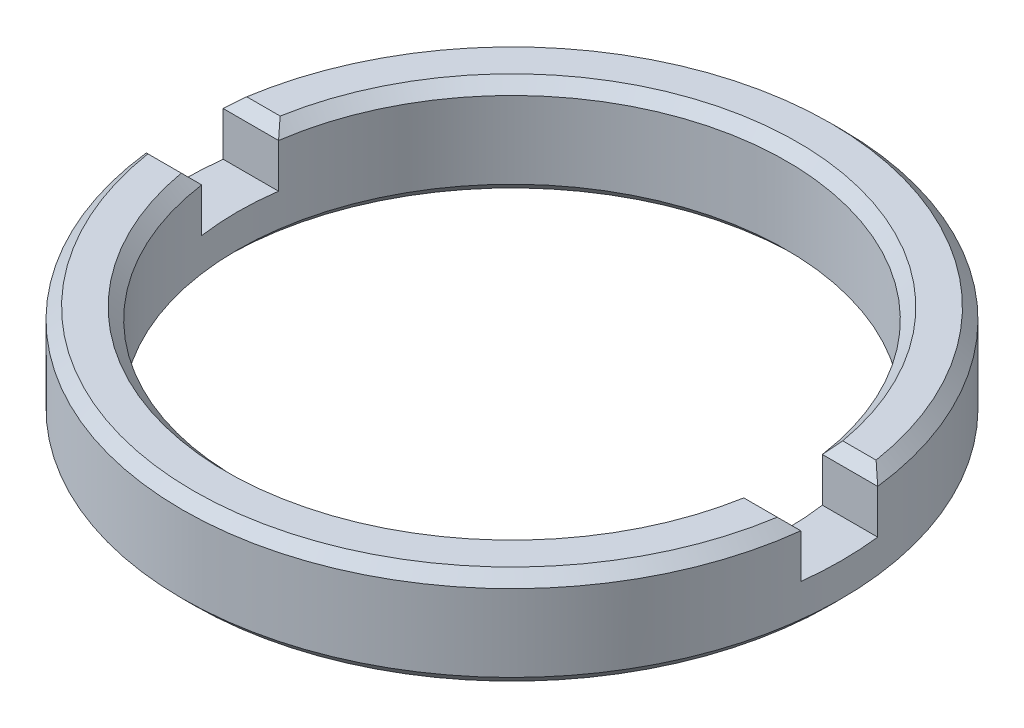
ISO-10303-21;
HEADER;
FILE_DESCRIPTION(('STEP AP214'),'2;1');
FILE_NAME('part.step','',(''),(''),'','','');
FILE_SCHEMA(('AUTOMOTIVE_DESIGN { 1 0 10303 214 1 1 1 1 }'));
ENDSEC;
DATA;
#1=APPLICATION_CONTEXT('core data for automotive mechanical design processes');
#2=APPLICATION_PROTOCOL_DEFINITION('international standard','automotive_design',2000,#1);
#3=PRODUCT_CONTEXT('',#1,'mechanical');
#4=PRODUCT('Part','Part','',(#3));
#5=PRODUCT_RELATED_PRODUCT_CATEGORY('part','',(#4));
#6=PRODUCT_DEFINITION_FORMATION('','',#4);
#7=PRODUCT_DEFINITION_CONTEXT('part definition',#1,'design');
#8=PRODUCT_DEFINITION('design','',#6,#7);
#9=PRODUCT_DEFINITION_SHAPE('','',#8);
#10=(LENGTH_UNIT() NAMED_UNIT(*) SI_UNIT(.MILLI.,.METRE.));
#11=(NAMED_UNIT(*) PLANE_ANGLE_UNIT() SI_UNIT($,.RADIAN.));
#12=(NAMED_UNIT(*) SI_UNIT($,.STERADIAN.) SOLID_ANGLE_UNIT());
#13=UNCERTAINTY_MEASURE_WITH_UNIT(LENGTH_MEASURE(1.E-05),#10,'distance_accuracy_value','');
#14=(GEOMETRIC_REPRESENTATION_CONTEXT(3) GLOBAL_UNCERTAINTY_ASSIGNED_CONTEXT((#13)) GLOBAL_UNIT_ASSIGNED_CONTEXT((#10,
#11,#12)) REPRESENTATION_CONTEXT('',''));
#15=CARTESIAN_POINT('',(0.,0.,0.));
#16=DIRECTION('',(0.,0.,1.));
#17=DIRECTION('',(1.,0.,0.));
#18=AXIS2_PLACEMENT_3D('',#15,#16,#17);
#19=CARTESIAN_POINT('',(0.,0.5715,0.));
#20=DIRECTION('',(0.,-1.,0.));
#21=DIRECTION('',(0.,0.,-1.));
#22=AXIS2_PLACEMENT_3D('',#19,#20,#21);
#23=CYLINDRICAL_SURFACE('',#22,3.81);
#24=CARTESIAN_POINT('',(0.,-0.444500000000001,0.));
#25=DIRECTION('',(0.,1.,0.));
#26=DIRECTION('',(0.,0.,1.));
#27=AXIS2_PLACEMENT_3D('',#24,#25,#26);
#28=CIRCLE('',#27,3.81);
#29=CARTESIAN_POINT('',(0.,-0.444500000000001,3.81));
#30=VERTEX_POINT('',#29);
#31=EDGE_CURVE('E168',#30,#30,#28,.T.);
#32=ORIENTED_EDGE('',*,*,#31,.T.);
#33=EDGE_LOOP('',(#32));
#34=FACE_BOUND('',#33,.T.);
#35=DIRECTION('',(0.,1.,0.));
#36=VECTOR('',#35,1.);
#37=CARTESIAN_POINT('',(-3.78398199652165,-0.0635000000000001,-0.4445));
#38=LINE('',#37,#36);
#39=CARTESIAN_POINT('',(-3.78398199652165,-0.0635000000000001,-0.4445));
#40=VERTEX_POINT('',#39);
#41=CARTESIAN_POINT('',(-3.78398199652165,0.4445,-0.4445));
#42=VERTEX_POINT('',#41);
#43=EDGE_CURVE('E137',#40,#42,#38,.T.);
#44=ORIENTED_EDGE('',*,*,#43,.T.);
#45=CARTESIAN_POINT('',(0.,0.4445,0.));
#46=DIRECTION('',(0.,1.,0.));
#47=DIRECTION('',(0.,0.,1.));
#48=AXIS2_PLACEMENT_3D('',#45,#46,#47);
#49=CIRCLE('',#48,3.81);
#50=CARTESIAN_POINT('',(3.78398199652165,0.4445,-0.4445));
#51=VERTEX_POINT('',#50);
#52=EDGE_CURVE('E166',#42,#51,#49,.F.);
#53=ORIENTED_EDGE('',*,*,#52,.T.);
#54=DIRECTION('',(0.,1.,0.));
#55=VECTOR('',#54,1.);
#56=CARTESIAN_POINT('',(3.78398199652165,-0.0635000000000001,-0.4445));
#57=LINE('',#56,#55);
#58=CARTESIAN_POINT('',(3.78398199652165,-0.0635000000000001,-0.4445));
#59=VERTEX_POINT('',#58);
#60=EDGE_CURVE('E154',#59,#51,#57,.T.);
#61=ORIENTED_EDGE('',*,*,#60,.F.);
#62=CARTESIAN_POINT('',(0.,-0.0635000000000001,0.));
#63=DIRECTION('',(0.,-1.,0.));
#64=DIRECTION('',(0.,0.,-1.));
#65=AXIS2_PLACEMENT_3D('',#62,#63,#64);
#66=CIRCLE('',#65,3.81);
#67=CARTESIAN_POINT('',(3.78398199652165,-0.0635000000000001,0.4445));
#68=VERTEX_POINT('',#67);
#69=EDGE_CURVE('E139',#59,#68,#66,.T.);
#70=ORIENTED_EDGE('',*,*,#69,.T.);
#71=DIRECTION('',(0.,1.,0.));
#72=VECTOR('',#71,1.);
#73=CARTESIAN_POINT('',(3.78398199652165,-0.0635000000000001,0.4445));
#74=LINE('',#73,#72);
#75=CARTESIAN_POINT('',(3.78398199652165,0.4445,0.4445));
#76=VERTEX_POINT('',#75);
#77=EDGE_CURVE('E163',#68,#76,#74,.T.);
#78=ORIENTED_EDGE('',*,*,#77,.T.);
#79=CARTESIAN_POINT('',(0.,0.4445,0.));
#80=DIRECTION('',(0.,1.,0.));
#81=DIRECTION('',(0.,0.,1.));
#82=AXIS2_PLACEMENT_3D('',#79,#80,#81);
#83=CIRCLE('',#82,3.81);
#84=CARTESIAN_POINT('',(-3.78398199652165,0.4445,0.444500000000001));
#85=VERTEX_POINT('',#84);
#86=EDGE_CURVE('E136',#76,#85,#83,.F.);
#87=ORIENTED_EDGE('',*,*,#86,.T.);
#88=DIRECTION('',(0.,1.,0.));
#89=VECTOR('',#88,1.);
#90=CARTESIAN_POINT('',(-3.78398199652165,-0.0635000000000001,0.444500000000001));
#91=LINE('',#90,#89);
#92=CARTESIAN_POINT('',(-3.78398199652165,-0.0635000000000001,0.444500000000001));
#93=VERTEX_POINT('',#92);
#94=EDGE_CURVE('E117',#93,#85,#91,.T.);
#95=ORIENTED_EDGE('',*,*,#94,.F.);
#96=CARTESIAN_POINT('',(0.,-0.0635000000000001,0.));
#97=DIRECTION('',(0.,-1.,0.));
#98=DIRECTION('',(0.,0.,-1.));
#99=AXIS2_PLACEMENT_3D('',#96,#97,#98);
#100=CIRCLE('',#99,3.81);
#101=EDGE_CURVE('E124',#93,#40,#100,.T.);
#102=ORIENTED_EDGE('',*,*,#101,.T.);
#103=EDGE_LOOP('',(#44,#53,#61,#70,#78,#87,#95,#102));
#104=FACE_BOUND('',#103,.T.);
#105=ADVANCED_FACE('F16',(#34,#104),#23,.T.);
#106=CARTESIAN_POINT('',(0.,0.5715,0.));
#107=DIRECTION('',(0.,1.,0.));
#108=DIRECTION('',(0.,0.,1.));
#109=AXIS2_PLACEMENT_3D('',#106,#107,#108);
#110=PLANE('',#109);
#111=DIRECTION('',(-1.,0.,0.));
#112=VECTOR('',#111,1.);
#113=CARTESIAN_POINT('',(0.,0.5715,0.571500000000001));
#114=LINE('',#113,#112);
#115=CARTESIAN_POINT('',(3.6383893070973,0.5715,0.571500000000001));
#116=VERTEX_POINT('',#115);
#117=CARTESIAN_POINT('',(3.25216723893468,0.5715,0.571500000000001));
#118=VERTEX_POINT('',#117);
#119=EDGE_CURVE('E37',#116,#118,#114,.T.);
#120=ORIENTED_EDGE('',*,*,#119,.T.);
#121=CARTESIAN_POINT('',(0.,0.5715,0.));
#122=DIRECTION('',(0.,1.,0.));
#123=DIRECTION('',(0.,0.,1.));
#124=AXIS2_PLACEMENT_3D('',#121,#122,#123);
#125=CIRCLE('',#124,3.302);
#126=CARTESIAN_POINT('',(-3.25216723893468,0.5715,0.571500000000001));
#127=VERTEX_POINT('',#126);
#128=EDGE_CURVE('E204',#118,#127,#125,.F.);
#129=ORIENTED_EDGE('',*,*,#128,.T.);
#130=DIRECTION('',(-1.,0.,0.));
#131=VECTOR('',#130,1.);
#132=CARTESIAN_POINT('',(0.,0.5715,0.571500000000001));
#133=LINE('',#132,#131);
#134=CARTESIAN_POINT('',(-3.6383893070973,0.5715,0.571500000000001));
#135=VERTEX_POINT('',#134);
#136=EDGE_CURVE('E201',#127,#135,#133,.T.);
#137=ORIENTED_EDGE('',*,*,#136,.T.);
#138=CARTESIAN_POINT('',(0.,0.5715,0.));
#139=DIRECTION('',(0.,1.,0.));
#140=DIRECTION('',(0.,0.,1.));
#141=AXIS2_PLACEMENT_3D('',#138,#139,#140);
#142=CIRCLE('',#141,3.683);
#143=EDGE_CURVE('E199',#135,#116,#142,.T.);
#144=ORIENTED_EDGE('',*,*,#143,.T.);
#145=EDGE_LOOP('',(#120,#129,#137,#144));
#146=FACE_BOUND('',#145,.T.);
#147=ADVANCED_FACE('F277',(#146),#110,.T.);
#148=DIRECTION('',(1.,0.,0.));
#149=VECTOR('',#148,1.);
#150=CARTESIAN_POINT('',(0.,0.5715,-0.571500000000001));
#151=LINE('',#150,#149);
#152=CARTESIAN_POINT('',(-3.6383893070973,0.5715,-0.571500000000001));
#153=VERTEX_POINT('',#152);
#154=CARTESIAN_POINT('',(-3.25216723893468,0.5715,-0.571500000000001));
#155=VERTEX_POINT('',#154);
#156=EDGE_CURVE('E188',#153,#155,#151,.T.);
#157=ORIENTED_EDGE('',*,*,#156,.T.);
#158=CARTESIAN_POINT('',(0.,0.5715,0.));
#159=DIRECTION('',(0.,1.,0.));
#160=DIRECTION('',(0.,0.,1.));
#161=AXIS2_PLACEMENT_3D('',#158,#159,#160);
#162=CIRCLE('',#161,3.302);
#163=CARTESIAN_POINT('',(3.25216723893468,0.5715,-0.571500000000001));
#164=VERTEX_POINT('',#163);
#165=EDGE_CURVE('E192',#155,#164,#162,.F.);
#166=ORIENTED_EDGE('',*,*,#165,.T.);
#167=DIRECTION('',(1.,0.,0.));
#168=VECTOR('',#167,1.);
#169=CARTESIAN_POINT('',(0.,0.5715,-0.571500000000001));
#170=LINE('',#169,#168);
#171=CARTESIAN_POINT('',(3.6383893070973,0.5715,-0.571500000000001));
#172=VERTEX_POINT('',#171);
#173=EDGE_CURVE('E190',#164,#172,#170,.T.);
#174=ORIENTED_EDGE('',*,*,#173,.T.);
#175=CARTESIAN_POINT('',(0.,0.5715,0.));
#176=DIRECTION('',(0.,1.,0.));
#177=DIRECTION('',(0.,0.,1.));
#178=AXIS2_PLACEMENT_3D('',#175,#176,#177);
#179=CIRCLE('',#178,3.683);
#180=EDGE_CURVE('E186',#172,#153,#179,.T.);
#181=ORIENTED_EDGE('',*,*,#180,.T.);
#182=EDGE_LOOP('',(#157,#166,#174,#181));
#183=FACE_BOUND('',#182,.T.);
#184=ADVANCED_FACE('F283',(#183),#110,.T.);
#185=CARTESIAN_POINT('',(0.,0.5715,0.));
#186=DIRECTION('',(0.,-1.,0.));
#187=DIRECTION('',(0.,0.,-1.));
#188=AXIS2_PLACEMENT_3D('',#185,#186,#187);
#189=CYLINDRICAL_SURFACE('',#188,3.175);
#190=CARTESIAN_POINT('',(0.,-0.4445,0.));
#191=DIRECTION('',(0.,1.,0.));
#192=DIRECTION('',(0.,0.,1.));
#193=AXIS2_PLACEMENT_3D('',#190,#191,#192);
#194=CIRCLE('',#193,3.175);
#195=CARTESIAN_POINT('',(0.,-0.4445,3.175));
#196=VERTEX_POINT('',#195);
#197=EDGE_CURVE('E183',#196,#196,#194,.F.);
#198=ORIENTED_EDGE('',*,*,#197,.T.);
#199=EDGE_LOOP('',(#198));
#200=FACE_BOUND('',#199,.T.);
#201=DIRECTION('',(0.,1.,0.));
#202=VECTOR('',#201,1.);
#203=CARTESIAN_POINT('',(3.14373102379959,-0.0635000000000001,-0.4445));
#204=LINE('',#203,#202);
#205=CARTESIAN_POINT('',(3.14373102379959,-0.0635000000000001,-0.4445));
#206=VERTEX_POINT('',#205);
#207=CARTESIAN_POINT('',(3.14373102379959,0.4445,-0.4445));
#208=VERTEX_POINT('',#207);
#209=EDGE_CURVE('E157',#206,#208,#204,.T.);
#210=ORIENTED_EDGE('',*,*,#209,.T.);
#211=CARTESIAN_POINT('',(0.,0.4445,0.));
#212=DIRECTION('',(0.,1.,0.));
#213=DIRECTION('',(0.,0.,1.));
#214=AXIS2_PLACEMENT_3D('',#211,#212,#213);
#215=CIRCLE('',#214,3.175);
#216=CARTESIAN_POINT('',(-3.14373102379959,0.4445,-0.4445));
#217=VERTEX_POINT('',#216);
#218=EDGE_CURVE('E180',#208,#217,#215,.T.);
#219=ORIENTED_EDGE('',*,*,#218,.T.);
#220=DIRECTION('',(0.,1.,0.));
#221=VECTOR('',#220,1.);
#222=CARTESIAN_POINT('',(-3.14373102379959,-0.0635000000000001,-0.4445));
#223=LINE('',#222,#221);
#224=CARTESIAN_POINT('',(-3.14373102379959,-0.0635000000000001,-0.4445));
#225=VERTEX_POINT('',#224);
#226=EDGE_CURVE('E141',#225,#217,#223,.T.);
#227=ORIENTED_EDGE('',*,*,#226,.F.);
#228=CARTESIAN_POINT('',(0.,-0.0635000000000001,0.));
#229=DIRECTION('',(0.,1.,0.));
#230=DIRECTION('',(0.,0.,-1.));
#231=AXIS2_PLACEMENT_3D('',#228,#229,#230);
#232=CIRCLE('',#231,3.175);
#233=CARTESIAN_POINT('',(-3.14373102379959,-0.0635000000000001,0.4445));
#234=VERTEX_POINT('',#233);
#235=EDGE_CURVE('E125',#225,#234,#232,.T.);
#236=ORIENTED_EDGE('',*,*,#235,.T.);
#237=DIRECTION('',(0.,1.,0.));
#238=VECTOR('',#237,1.);
#239=CARTESIAN_POINT('',(-3.14373102379959,-0.0635000000000001,0.4445));
#240=LINE('',#239,#238);
#241=CARTESIAN_POINT('',(-3.14373102379959,0.4445,0.4445));
#242=VERTEX_POINT('',#241);
#243=EDGE_CURVE('E120',#234,#242,#240,.T.);
#244=ORIENTED_EDGE('',*,*,#243,.T.);
#245=CARTESIAN_POINT('',(0.,0.4445,0.));
#246=DIRECTION('',(0.,1.,0.));
#247=DIRECTION('',(0.,0.,1.));
#248=AXIS2_PLACEMENT_3D('',#245,#246,#247);
#249=CIRCLE('',#248,3.175);
#250=CARTESIAN_POINT('',(3.14373102379959,0.4445,0.4445));
#251=VERTEX_POINT('',#250);
#252=EDGE_CURVE('E177',#242,#251,#249,.T.);
#253=ORIENTED_EDGE('',*,*,#252,.T.);
#254=DIRECTION('',(0.,1.,0.));
#255=VECTOR('',#254,1.);
#256=CARTESIAN_POINT('',(3.14373102379959,-0.0635000000000001,0.4445));
#257=LINE('',#256,#255);
#258=CARTESIAN_POINT('',(3.14373102379959,-0.0635000000000001,0.4445));
#259=VERTEX_POINT('',#258);
#260=EDGE_CURVE('E160',#259,#251,#257,.T.);
#261=ORIENTED_EDGE('',*,*,#260,.F.);
#262=CARTESIAN_POINT('',(0.,-0.0635000000000001,0.));
#263=DIRECTION('',(0.,1.,0.));
#264=DIRECTION('',(0.,0.,-1.));
#265=AXIS2_PLACEMENT_3D('',#262,#263,#264);
#266=CIRCLE('',#265,3.175);
#267=EDGE_CURVE('E149',#259,#206,#266,.T.);
#268=ORIENTED_EDGE('',*,*,#267,.T.);
#269=EDGE_LOOP('',(#210,#219,#227,#236,#244,#253,#261,#268));
#270=FACE_BOUND('',#269,.T.);
#271=ADVANCED_FACE('F302',(#200,#270),#189,.F.);
#272=CARTESIAN_POINT('',(0.,-0.5715,0.));
#273=DIRECTION('',(0.,1.,0.));
#274=DIRECTION('',(0.,0.,1.));
#275=AXIS2_PLACEMENT_3D('',#272,#273,#274);
#276=PLANE('',#275);
#277=CARTESIAN_POINT('',(0.,-0.5715,0.));
#278=DIRECTION('',(0.,1.,0.));
#279=DIRECTION('',(0.,0.,1.));
#280=AXIS2_PLACEMENT_3D('',#277,#278,#279);
#281=CIRCLE('',#280,3.683);
#282=CARTESIAN_POINT('',(0.,-0.5715,3.683));
#283=VERTEX_POINT('',#282);
#284=EDGE_CURVE('E174',#283,#283,#281,.F.);
#285=ORIENTED_EDGE('',*,*,#284,.T.);
#286=EDGE_LOOP('',(#285));
#287=FACE_BOUND('',#286,.T.);
#288=CARTESIAN_POINT('',(0.,-0.5715,0.));
#289=DIRECTION('',(0.,1.,0.));
#290=DIRECTION('',(0.,0.,1.));
#291=AXIS2_PLACEMENT_3D('',#288,#289,#290);
#292=CIRCLE('',#291,3.302);
#293=CARTESIAN_POINT('',(0.,-0.5715,3.302));
#294=VERTEX_POINT('',#293);
#295=EDGE_CURVE('E171',#294,#294,#292,.T.);
#296=ORIENTED_EDGE('',*,*,#295,.T.);
#297=EDGE_LOOP('',(#296));
#298=FACE_BOUND('',#297,.T.);
#299=ADVANCED_FACE('F287',(#287,#298),#276,.F.);
#300=CARTESIAN_POINT('',(3.14373102379959,-0.0635000000000001,0.4445));
#301=DIRECTION('',(0.,0.,-1.));
#302=DIRECTION('',(-1.,0.,0.));
#303=AXIS2_PLACEMENT_3D('',#300,#301,#302);
#304=PLANE('',#303);
#305=ORIENTED_EDGE('',*,*,#260,.T.);
#306=DIRECTION('',(1.,0.,0.));
#307=VECTOR('',#306,1.);
#308=CARTESIAN_POINT('',(3.14373102379959,0.4445,0.4445));
#309=LINE('',#308,#307);
#310=EDGE_CURVE('E29',#251,#76,#309,.T.);
#311=ORIENTED_EDGE('',*,*,#310,.T.);
#312=ORIENTED_EDGE('',*,*,#77,.F.);
#313=DIRECTION('',(-1.,0.,0.));
#314=VECTOR('',#313,1.);
#315=CARTESIAN_POINT('',(3.14373102379959,-0.0635000000000001,0.4445));
#316=LINE('',#315,#314);
#317=EDGE_CURVE('E147',#68,#259,#316,.T.);
#318=ORIENTED_EDGE('',*,*,#317,.T.);
#319=EDGE_LOOP('',(#305,#311,#312,#318));
#320=FACE_BOUND('',#319,.T.);
#321=ADVANCED_FACE('F347',(#320),#304,.T.);
#322=CARTESIAN_POINT('',(3.14373102379959,-0.0635000000000001,-0.4445));
#323=DIRECTION('',(0.,0.,1.));
#324=DIRECTION('',(1.,0.,0.));
#325=AXIS2_PLACEMENT_3D('',#322,#323,#324);
#326=PLANE('',#325);
#327=ORIENTED_EDGE('',*,*,#60,.T.);
#328=DIRECTION('',(-1.,0.,0.));
#329=VECTOR('',#328,1.);
#330=CARTESIAN_POINT('',(3.14373102379959,0.4445,-0.4445));
#331=LINE('',#330,#329);
#332=EDGE_CURVE('E195',#51,#208,#331,.T.);
#333=ORIENTED_EDGE('',*,*,#332,.T.);
#334=ORIENTED_EDGE('',*,*,#209,.F.);
#335=DIRECTION('',(1.,0.,0.));
#336=VECTOR('',#335,1.);
#337=CARTESIAN_POINT('',(3.14373102379959,-0.0635000000000001,-0.4445));
#338=LINE('',#337,#336);
#339=EDGE_CURVE('E152',#206,#59,#338,.T.);
#340=ORIENTED_EDGE('',*,*,#339,.T.);
#341=EDGE_LOOP('',(#327,#333,#334,#340));
#342=FACE_BOUND('',#341,.T.);
#343=ADVANCED_FACE('F330',(#342),#326,.T.);
#344=CARTESIAN_POINT('',(0.,-0.0635000000000001,0.));
#345=DIRECTION('',(0.,-1.,0.));
#346=DIRECTION('',(0.,0.,-1.));
#347=AXIS2_PLACEMENT_3D('',#344,#345,#346);
#348=PLANE('',#347);
#349=ORIENTED_EDGE('',*,*,#69,.F.);
#350=ORIENTED_EDGE('',*,*,#339,.F.);
#351=ORIENTED_EDGE('',*,*,#267,.F.);
#352=ORIENTED_EDGE('',*,*,#317,.F.);
#353=EDGE_LOOP('',(#349,#350,#351,#352));
#354=FACE_BOUND('',#353,.T.);
#355=ADVANCED_FACE('F333',(#354),#348,.F.);
#356=CARTESIAN_POINT('',(-3.78398199652165,-0.0635000000000001,0.4445));
#357=DIRECTION('',(0.,0.,-1.));
#358=DIRECTION('',(-1.,0.,0.));
#359=AXIS2_PLACEMENT_3D('',#356,#357,#358);
#360=PLANE('',#359);
#361=ORIENTED_EDGE('',*,*,#94,.T.);
#362=DIRECTION('',(1.,0.,0.));
#363=VECTOR('',#362,1.);
#364=CARTESIAN_POINT('',(-3.78398199652165,0.4445,0.4445));
#365=LINE('',#364,#363);
#366=EDGE_CURVE('E10',#85,#242,#365,.T.);
#367=ORIENTED_EDGE('',*,*,#366,.T.);
#368=ORIENTED_EDGE('',*,*,#243,.F.);
#369=DIRECTION('',(-1.,0.,0.));
#370=VECTOR('',#369,1.);
#371=CARTESIAN_POINT('',(-3.78398199652165,-0.0635000000000001,0.4445));
#372=LINE('',#371,#370);
#373=EDGE_CURVE('E113',#234,#93,#372,.T.);
#374=ORIENTED_EDGE('',*,*,#373,.T.);
#375=EDGE_LOOP('',(#361,#367,#368,#374));
#376=FACE_BOUND('',#375,.T.);
#377=ADVANCED_FACE('F115',(#376),#360,.T.);
#378=CARTESIAN_POINT('',(-3.78398199652165,-0.0635000000000001,-0.4445));
#379=DIRECTION('',(0.,0.,1.));
#380=DIRECTION('',(1.,0.,0.));
#381=AXIS2_PLACEMENT_3D('',#378,#379,#380);
#382=PLANE('',#381);
#383=ORIENTED_EDGE('',*,*,#226,.T.);
#384=DIRECTION('',(-1.,0.,0.));
#385=VECTOR('',#384,1.);
#386=CARTESIAN_POINT('',(-3.78398199652165,0.4445,-0.4445));
#387=LINE('',#386,#385);
#388=EDGE_CURVE('E197',#217,#42,#387,.T.);
#389=ORIENTED_EDGE('',*,*,#388,.T.);
#390=ORIENTED_EDGE('',*,*,#43,.F.);
#391=DIRECTION('',(1.,0.,0.));
#392=VECTOR('',#391,1.);
#393=CARTESIAN_POINT('',(-3.78398199652165,-0.0635000000000001,-0.4445));
#394=LINE('',#393,#392);
#395=EDGE_CURVE('E130',#40,#225,#394,.T.);
#396=ORIENTED_EDGE('',*,*,#395,.T.);
#397=EDGE_LOOP('',(#383,#389,#390,#396));
#398=FACE_BOUND('',#397,.T.);
#399=ADVANCED_FACE('F327',(#398),#382,.T.);
#400=CARTESIAN_POINT('',(0.,-0.0635000000000001,0.));
#401=DIRECTION('',(0.,-1.,0.));
#402=DIRECTION('',(0.,0.,-1.));
#403=AXIS2_PLACEMENT_3D('',#400,#401,#402);
#404=PLANE('',#403);
#405=ORIENTED_EDGE('',*,*,#235,.F.);
#406=ORIENTED_EDGE('',*,*,#395,.F.);
#407=ORIENTED_EDGE('',*,*,#101,.F.);
#408=ORIENTED_EDGE('',*,*,#373,.F.);
#409=EDGE_LOOP('',(#405,#406,#407,#408));
#410=FACE_BOUND('',#409,.T.);
#411=ADVANCED_FACE('F129',(#410),#404,.F.);
#412=CARTESIAN_POINT('',(0.,-0.444500000000001,0.));
#413=DIRECTION('',(0.,1.,0.));
#414=DIRECTION('',(0.,0.,1.));
#415=AXIS2_PLACEMENT_3D('',#412,#413,#414);
#416=CONICAL_SURFACE('',#415,3.81,0.785398163397442);
#417=ORIENTED_EDGE('',*,*,#284,.F.);
#418=EDGE_LOOP('',(#417));
#419=FACE_BOUND('',#418,.T.);
#420=ORIENTED_EDGE('',*,*,#31,.F.);
#421=EDGE_LOOP('',(#420));
#422=FACE_BOUND('',#421,.T.);
#423=ADVANCED_FACE('F288',(#419,#422),#416,.T.);
#424=CARTESIAN_POINT('',(0.,-0.4445,0.));
#425=DIRECTION('',(0.,-1.,0.));
#426=DIRECTION('',(0.,0.,-1.));
#427=AXIS2_PLACEMENT_3D('',#424,#425,#426);
#428=CONICAL_SURFACE('',#427,3.175,0.785398163397447);
#429=ORIENTED_EDGE('',*,*,#295,.F.);
#430=EDGE_LOOP('',(#429));
#431=FACE_BOUND('',#430,.T.);
#432=ORIENTED_EDGE('',*,*,#197,.F.);
#433=EDGE_LOOP('',(#432));
#434=FACE_BOUND('',#433,.T.);
#435=ADVANCED_FACE('F290',(#431,#434),#428,.F.);
#436=CARTESIAN_POINT('',(0.,0.5715,0.));
#437=DIRECTION('',(0.,-1.,0.));
#438=DIRECTION('',(0.,0.,-1.));
#439=AXIS2_PLACEMENT_3D('',#436,#437,#438);
#440=CONICAL_SURFACE('',#439,3.683,0.785398163397452);
#441=CARTESIAN_POINT('',(3.6383893070973,0.5715,-0.571500000000001));
#442=CARTESIAN_POINT('',(3.66294198659735,0.550497960481669,-0.55049796048167));
#443=CARTESIAN_POINT('',(3.68735105514396,0.529413603227663,-0.529413603227664));
#444=CARTESIAN_POINT('',(3.73588195139461,0.487080269765856,-0.487080269765856));
#445=CARTESIAN_POINT('',(3.76000377932278,0.465831293686528,-0.465831293686528));
#446=CARTESIAN_POINT('',(3.78398199652165,0.4445,-0.4445));
#447=B_SPLINE_CURVE_WITH_KNOTS('',3,(#441,#442,#443,#444,#445,#446),.UNSPECIFIED.,.F.,.F.,(4,2,
4),(0.,0.115603312324865,0.231206534437938),.UNSPECIFIED.);
#448=EDGE_CURVE('E244',#51,#172,#447,.F.);
#449=ORIENTED_EDGE('',*,*,#448,.F.);
#450=ORIENTED_EDGE('',*,*,#52,.F.);
#451=CARTESIAN_POINT('',(-3.78398199652165,0.4445,-0.4445));
#452=CARTESIAN_POINT('',(-3.76000377932278,0.465831293686528,-0.465831293686528));
#453=CARTESIAN_POINT('',(-3.73588195139461,0.487080269765856,-0.487080269765856));
#454=CARTESIAN_POINT('',(-3.68735105514396,0.529413603227663,-0.529413603227664));
#455=CARTESIAN_POINT('',(-3.66294198659735,0.550497960481669,-0.55049796048167));
#456=CARTESIAN_POINT('',(-3.6383893070973,0.5715,-0.571500000000001));
#457=B_SPLINE_CURVE_WITH_KNOTS('',3,(#451,#452,#453,#454,#455,#456),.UNSPECIFIED.,.F.,.F.,(4,2,
4),(0.,0.115603222113072,0.231206534437938),.UNSPECIFIED.);
#458=EDGE_CURVE('E238',#153,#42,#457,.F.);
#459=ORIENTED_EDGE('',*,*,#458,.F.);
#460=ORIENTED_EDGE('',*,*,#180,.F.);
#461=EDGE_LOOP('',(#449,#450,#459,#460));
#462=FACE_BOUND('',#461,.T.);
#463=ADVANCED_FACE('F232',(#462),#440,.T.);
#464=CARTESIAN_POINT('',(0.,0.5715,-0.571500000000001));
#465=DIRECTION('',(0.,-0.70710678118655,-0.707106781186545));
#466=DIRECTION('',(1.,0.,0.));
#467=AXIS2_PLACEMENT_3D('',#464,#465,#466);
#468=PLANE('',#467);
#469=ORIENTED_EDGE('',*,*,#458,.T.);
#470=ORIENTED_EDGE('',*,*,#388,.F.);
#471=CARTESIAN_POINT('',(-3.14373102379959,0.4445,-0.4445));
#472=CARTESIAN_POINT('',(-3.1620282756174,0.465570811344419,-0.465570811344419));
#473=CARTESIAN_POINT('',(-3.18021325524944,0.486689553282787,-0.486689553282787));
#474=CARTESIAN_POINT('',(-3.21635866017058,0.52902288666901,-0.52902288666901));
#475=CARTESIAN_POINT('',(-3.23431908558358,0.550237478063976,-0.550237478063976));
#476=CARTESIAN_POINT('',(-3.25216723893468,0.5715,-0.571500000000001));
#477=B_SPLINE_CURVE_WITH_KNOTS('',3,(#471,#472,#473,#474,#475,#476),.UNSPECIFIED.,.F.,.F.,(4,2,
4),(0.,0.104901210941656,0.209802364005571),.UNSPECIFIED.);
#478=EDGE_CURVE('E214',#155,#217,#477,.F.);
#479=ORIENTED_EDGE('',*,*,#478,.F.);
#480=ORIENTED_EDGE('',*,*,#156,.F.);
#481=EDGE_LOOP('',(#469,#470,#479,#480));
#482=FACE_BOUND('',#481,.T.);
#483=ADVANCED_FACE('F227',(#482),#468,.F.);
#484=CARTESIAN_POINT('',(0.,0.5715,-0.571500000000001));
#485=DIRECTION('',(0.,-0.70710678118655,-0.707106781186545));
#486=DIRECTION('',(1.,0.,0.));
#487=AXIS2_PLACEMENT_3D('',#484,#485,#486);
#488=PLANE('',#487);
#489=ORIENTED_EDGE('',*,*,#448,.T.);
#490=ORIENTED_EDGE('',*,*,#173,.F.);
#491=CARTESIAN_POINT('',(3.25216723893468,0.5715,-0.571500000000001));
#492=CARTESIAN_POINT('',(3.23431908558358,0.550237478063976,-0.550237478063976));
#493=CARTESIAN_POINT('',(3.21635866017058,0.52902288666901,-0.529022886669011));
#494=CARTESIAN_POINT('',(3.18021325524944,0.486689553282787,-0.486689553282787));
#495=CARTESIAN_POINT('',(3.1620282756174,0.465570811344419,-0.465570811344419));
#496=CARTESIAN_POINT('',(3.14373102379959,0.4445,-0.4445));
#497=B_SPLINE_CURVE_WITH_KNOTS('',3,(#491,#492,#493,#494,#495,#496),.UNSPECIFIED.,.F.,.F.,(4,2,
4),(0.,0.104901153063915,0.209802364005571),.UNSPECIFIED.);
#498=EDGE_CURVE('E207',#208,#164,#497,.F.);
#499=ORIENTED_EDGE('',*,*,#498,.F.);
#500=ORIENTED_EDGE('',*,*,#332,.F.);
#501=EDGE_LOOP('',(#489,#490,#499,#500));
#502=FACE_BOUND('',#501,.T.);
#503=ADVANCED_FACE('F220',(#502),#488,.F.);
#504=CARTESIAN_POINT('',(0.,0.5715,0.));
#505=DIRECTION('',(0.,1.,0.));
#506=DIRECTION('',(0.,0.,1.));
#507=AXIS2_PLACEMENT_3D('',#504,#505,#506);
#508=CONICAL_SURFACE('',#507,3.302,0.785398163397452);
#509=ORIENTED_EDGE('',*,*,#478,.T.);
#510=ORIENTED_EDGE('',*,*,#218,.F.);
#511=ORIENTED_EDGE('',*,*,#498,.T.);
#512=ORIENTED_EDGE('',*,*,#165,.F.);
#513=EDGE_LOOP('',(#509,#510,#511,#512));
#514=FACE_BOUND('',#513,.T.);
#515=ADVANCED_FACE('F223',(#514),#508,.F.);
#516=CARTESIAN_POINT('',(0.,0.5715,0.));
#517=DIRECTION('',(0.,-1.,0.));
#518=DIRECTION('',(0.,0.,-1.));
#519=AXIS2_PLACEMENT_3D('',#516,#517,#518);
#520=CONICAL_SURFACE('',#519,3.683,0.785398163397452);
#521=CARTESIAN_POINT('',(-3.6383893070973,0.5715,0.571500000000001));
#522=CARTESIAN_POINT('',(-3.66294198659735,0.550497960481669,0.55049796048167));
#523=CARTESIAN_POINT('',(-3.68735105514396,0.529413603227664,0.529413603227664));
#524=CARTESIAN_POINT('',(-3.73588195139461,0.487080269765856,0.487080269765856));
#525=CARTESIAN_POINT('',(-3.76000377932278,0.465831293686528,0.465831293686528));
#526=CARTESIAN_POINT('',(-3.78398199652165,0.4445,0.4445));
#527=B_SPLINE_CURVE_WITH_KNOTS('',3,(#521,#522,#523,#524,#525,#526),.UNSPECIFIED.,.F.,.F.,(4,2,
4),(0.,0.115603312324864,0.231206534437937),.UNSPECIFIED.);
#528=EDGE_CURVE('E339',#85,#135,#527,.F.);
#529=ORIENTED_EDGE('',*,*,#528,.F.);
#530=ORIENTED_EDGE('',*,*,#86,.F.);
#531=CARTESIAN_POINT('',(3.78398199652165,0.4445,0.4445));
#532=CARTESIAN_POINT('',(3.76000377932278,0.465831293686528,0.465831293686528));
#533=CARTESIAN_POINT('',(3.73588195139461,0.487080269765856,0.487080269765856));
#534=CARTESIAN_POINT('',(3.68735105514396,0.529413603227663,0.529413603227664));
#535=CARTESIAN_POINT('',(3.66294198659735,0.550497960481669,0.55049796048167));
#536=CARTESIAN_POINT('',(3.6383893070973,0.5715,0.571500000000001));
#537=B_SPLINE_CURVE_WITH_KNOTS('',3,(#531,#532,#533,#534,#535,#536),.UNSPECIFIED.,.F.,.F.,(4,2,
4),(0.,0.115603222113072,0.231206534437938),.UNSPECIFIED.);
#538=EDGE_CURVE('E21',#116,#76,#537,.F.);
#539=ORIENTED_EDGE('',*,*,#538,.F.);
#540=ORIENTED_EDGE('',*,*,#143,.F.);
#541=EDGE_LOOP('',(#529,#530,#539,#540));
#542=FACE_BOUND('',#541,.T.);
#543=ADVANCED_FACE('F18',(#542),#520,.T.);
#544=CARTESIAN_POINT('',(0.,0.5715,0.571500000000001));
#545=DIRECTION('',(0.,-0.70710678118655,0.707106781186545));
#546=DIRECTION('',(-1.,0.,0.));
#547=AXIS2_PLACEMENT_3D('',#544,#545,#546);
#548=PLANE('',#547);
#549=ORIENTED_EDGE('',*,*,#538,.T.);
#550=ORIENTED_EDGE('',*,*,#310,.F.);
#551=CARTESIAN_POINT('',(3.14373102379959,0.4445,0.4445));
#552=CARTESIAN_POINT('',(3.1620282756174,0.465570811344419,0.465570811344419));
#553=CARTESIAN_POINT('',(3.18021325524944,0.486689553282787,0.486689553282787));
#554=CARTESIAN_POINT('',(3.21635866017058,0.52902288666901,0.52902288666901));
#555=CARTESIAN_POINT('',(3.23431908558358,0.550237478063976,0.550237478063976));
#556=CARTESIAN_POINT('',(3.25216723893468,0.5715,0.571500000000001));
#557=B_SPLINE_CURVE_WITH_KNOTS('',3,(#551,#552,#553,#554,#555,#556),.UNSPECIFIED.,.F.,.F.,(4,2,
4),(0.,0.104901210941656,0.209802364005571),.UNSPECIFIED.);
#558=EDGE_CURVE('E253',#118,#251,#557,.F.);
#559=ORIENTED_EDGE('',*,*,#558,.F.);
#560=ORIENTED_EDGE('',*,*,#119,.F.);
#561=EDGE_LOOP('',(#549,#550,#559,#560));
#562=FACE_BOUND('',#561,.T.);
#563=ADVANCED_FACE('F262',(#562),#548,.F.);
#564=CARTESIAN_POINT('',(0.,0.5715,0.571500000000001));
#565=DIRECTION('',(0.,-0.70710678118655,0.707106781186545));
#566=DIRECTION('',(-1.,0.,0.));
#567=AXIS2_PLACEMENT_3D('',#564,#565,#566);
#568=PLANE('',#567);
#569=ORIENTED_EDGE('',*,*,#528,.T.);
#570=ORIENTED_EDGE('',*,*,#136,.F.);
#571=CARTESIAN_POINT('',(-3.25216723893468,0.5715,0.571500000000001));
#572=CARTESIAN_POINT('',(-3.23431908558358,0.550237478063976,0.550237478063976));
#573=CARTESIAN_POINT('',(-3.21635866017058,0.52902288666901,0.52902288666901));
#574=CARTESIAN_POINT('',(-3.18021325524944,0.486689553282787,0.486689553282787));
#575=CARTESIAN_POINT('',(-3.1620282756174,0.465570811344419,0.465570811344419));
#576=CARTESIAN_POINT('',(-3.14373102379959,0.4445,0.4445));
#577=B_SPLINE_CURVE_WITH_KNOTS('',3,(#571,#572,#573,#574,#575,#576),.UNSPECIFIED.,.F.,.F.,(4,2,
4),(0.,0.104901153063915,0.209802364005571),.UNSPECIFIED.);
#578=EDGE_CURVE('E45',#242,#127,#577,.F.);
#579=ORIENTED_EDGE('',*,*,#578,.F.);
#580=ORIENTED_EDGE('',*,*,#366,.F.);
#581=EDGE_LOOP('',(#569,#570,#579,#580));
#582=FACE_BOUND('',#581,.T.);
#583=ADVANCED_FACE('F257',(#582),#568,.F.);
#584=CARTESIAN_POINT('',(0.,0.5715,0.));
#585=DIRECTION('',(0.,1.,0.));
#586=DIRECTION('',(0.,0.,1.));
#587=AXIS2_PLACEMENT_3D('',#584,#585,#586);
#588=CONICAL_SURFACE('',#587,3.302,0.785398163397452);
#589=ORIENTED_EDGE('',*,*,#558,.T.);
#590=ORIENTED_EDGE('',*,*,#252,.F.);
#591=ORIENTED_EDGE('',*,*,#578,.T.);
#592=ORIENTED_EDGE('',*,*,#128,.F.);
#593=EDGE_LOOP('',(#589,#590,#591,#592));
#594=FACE_BOUND('',#593,.T.);
#595=ADVANCED_FACE('F259',(#594),#588,.F.);
#596=CLOSED_SHELL('',(#105,#147,#184,#271,#299,#321,#343,#355,#377,#399,#411,#423,#435,#463,
#483,#503,#515,#543,#563,#583,#595));
#597=MANIFOLD_SOLID_BREP('B1',#596);
#598=ADVANCED_BREP_SHAPE_REPRESENTATION('',(#18,#597),#14);
#599=SHAPE_DEFINITION_REPRESENTATION(#9,#598);
ENDSEC;
END-ISO-10303-21;
